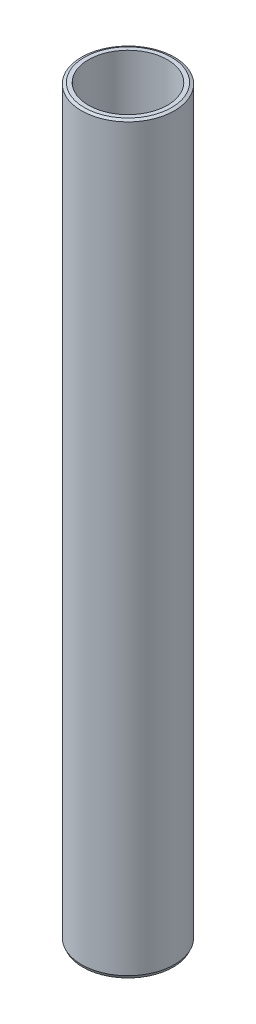
ISO-10303-21;
HEADER;
FILE_DESCRIPTION(('STEP AP214'),'2;1');
FILE_NAME('part.step','',(''),(''),'','','');
FILE_SCHEMA(('AUTOMOTIVE_DESIGN { 1 0 10303 214 1 1 1 1 }'));
ENDSEC;
DATA;
#1=APPLICATION_CONTEXT('core data for automotive mechanical design processes');
#2=APPLICATION_PROTOCOL_DEFINITION('international standard','automotive_design',2000,#1);
#3=PRODUCT_CONTEXT('',#1,'mechanical');
#4=PRODUCT('Part','Part','',(#3));
#5=PRODUCT_RELATED_PRODUCT_CATEGORY('part','',(#4));
#6=PRODUCT_DEFINITION_FORMATION('','',#4);
#7=PRODUCT_DEFINITION_CONTEXT('part definition',#1,'design');
#8=PRODUCT_DEFINITION('design','',#6,#7);
#9=PRODUCT_DEFINITION_SHAPE('','',#8);
#10=(LENGTH_UNIT() NAMED_UNIT(*) SI_UNIT(.MILLI.,.METRE.));
#11=(NAMED_UNIT(*) PLANE_ANGLE_UNIT() SI_UNIT($,.RADIAN.));
#12=(NAMED_UNIT(*) SI_UNIT($,.STERADIAN.) SOLID_ANGLE_UNIT());
#13=UNCERTAINTY_MEASURE_WITH_UNIT(LENGTH_MEASURE(1.E-05),#10,'distance_accuracy_value','');
#14=(GEOMETRIC_REPRESENTATION_CONTEXT(3) GLOBAL_UNCERTAINTY_ASSIGNED_CONTEXT((#13)) GLOBAL_UNIT_ASSIGNED_CONTEXT((#10,
#11,#12)) REPRESENTATION_CONTEXT('',''));
#15=CARTESIAN_POINT('',(0.,0.,0.));
#16=DIRECTION('',(0.,0.,1.));
#17=DIRECTION('',(1.,0.,0.));
#18=AXIS2_PLACEMENT_3D('',#15,#16,#17);
#19=CARTESIAN_POINT('',(0.,600.,0.));
#20=DIRECTION('',(0.,-1.,0.));
#21=DIRECTION('',(0.,0.,-1.));
#22=AXIS2_PLACEMENT_3D('',#19,#20,#21);
#23=CYLINDRICAL_SURFACE('',#22,37.5);
#24=CARTESIAN_POINT('',(0.,598.958116109623,0.));
#25=DIRECTION('',(0.,1.,0.));
#26=DIRECTION('',(0.,0.,1.));
#27=AXIS2_PLACEMENT_3D('',#24,#25,#26);
#28=CIRCLE('',#27,37.5);
#29=CARTESIAN_POINT('',(0.,598.958116109623,37.5));
#30=VERTEX_POINT('',#29);
#31=EDGE_CURVE('E50',#30,#30,#28,.F.);
#32=ORIENTED_EDGE('',*,*,#31,.T.);
#33=EDGE_LOOP('',(#32));
#34=FACE_BOUND('',#33,.T.);
#35=CARTESIAN_POINT('',(0.,2.32432728901266,0.));
#36=DIRECTION('',(0.,1.,0.));
#37=DIRECTION('',(0.,0.,1.));
#38=AXIS2_PLACEMENT_3D('',#35,#36,#37);
#39=CIRCLE('',#38,37.5);
#40=CARTESIAN_POINT('',(0.,2.32432728901266,37.5));
#41=VERTEX_POINT('',#40);
#42=EDGE_CURVE('E51',#41,#41,#39,.T.);
#43=ORIENTED_EDGE('',*,*,#42,.T.);
#44=EDGE_LOOP('',(#43));
#45=FACE_BOUND('',#44,.T.);
#46=ADVANCED_FACE('F39',(#34,#45),#23,.T.);
#47=CARTESIAN_POINT('',(0.,600.,0.));
#48=DIRECTION('',(0.,1.,0.));
#49=DIRECTION('',(0.,0.,1.));
#50=AXIS2_PLACEMENT_3D('',#47,#48,#49);
#51=PLANE('',#50);
#52=CARTESIAN_POINT('',(0.,600.,0.));
#53=DIRECTION('',(0.,1.,0.));
#54=DIRECTION('',(0.,0.,1.));
#55=AXIS2_PLACEMENT_3D('',#52,#53,#54);
#56=CIRCLE('',#55,35.1756727109879);
#57=CARTESIAN_POINT('',(0.,600.,35.1756727109879));
#58=VERTEX_POINT('',#57);
#59=EDGE_CURVE('E54',#58,#58,#56,.T.);
#60=ORIENTED_EDGE('',*,*,#59,.T.);
#61=EDGE_LOOP('',(#60));
#62=FACE_BOUND('',#61,.T.);
#63=CARTESIAN_POINT('',(0.,600.,0.));
#64=DIRECTION('',(0.,1.,0.));
#65=DIRECTION('',(0.,0.,1.));
#66=AXIS2_PLACEMENT_3D('',#63,#64,#65);
#67=CIRCLE('',#66,31.8581075449418);
#68=CARTESIAN_POINT('',(0.,600.,31.8581075449418));
#69=VERTEX_POINT('',#68);
#70=EDGE_CURVE('E58',#69,#69,#67,.T.);
#71=ORIENTED_EDGE('',*,*,#70,.F.);
#72=EDGE_LOOP('',(#71));
#73=FACE_BOUND('',#72,.T.);
#74=ADVANCED_FACE('F69',(#62,#73),#51,.T.);
#75=CARTESIAN_POINT('',(0.,0.,0.));
#76=DIRECTION('',(0.,1.,0.));
#77=DIRECTION('',(0.,0.,1.));
#78=AXIS2_PLACEMENT_3D('',#75,#76,#77);
#79=PLANE('',#78);
#80=CARTESIAN_POINT('',(0.,0.,0.));
#81=DIRECTION('',(0.,1.,0.));
#82=DIRECTION('',(0.,0.,1.));
#83=AXIS2_PLACEMENT_3D('',#80,#81,#82);
#84=CIRCLE('',#83,36.4581161096232);
#85=CARTESIAN_POINT('',(0.,0.,36.4581161096232));
#86=VERTEX_POINT('',#85);
#87=EDGE_CURVE('E10',#86,#86,#84,.F.);
#88=ORIENTED_EDGE('',*,*,#87,.T.);
#89=EDGE_LOOP('',(#88));
#90=FACE_BOUND('',#89,.T.);
#91=CARTESIAN_POINT('',(0.,0.,0.));
#92=DIRECTION('',(0.,1.,0.));
#93=DIRECTION('',(0.,0.,1.));
#94=AXIS2_PLACEMENT_3D('',#91,#92,#93);
#95=CIRCLE('',#94,31.8581075449418);
#96=CARTESIAN_POINT('',(0.,0.,31.8581075449418));
#97=VERTEX_POINT('',#96);
#98=EDGE_CURVE('E63',#97,#97,#95,.T.);
#99=ORIENTED_EDGE('',*,*,#98,.T.);
#100=EDGE_LOOP('',(#99));
#101=FACE_BOUND('',#100,.T.);
#102=ADVANCED_FACE('F75',(#90,#101),#79,.F.);
#103=CARTESIAN_POINT('',(0.,600.,0.));
#104=DIRECTION('',(0.,-1.,0.));
#105=DIRECTION('',(0.,0.,-1.));
#106=AXIS2_PLACEMENT_3D('',#103,#104,#105);
#107=CYLINDRICAL_SURFACE('',#106,31.8581075449418);
#108=ORIENTED_EDGE('',*,*,#70,.T.);
#109=EDGE_LOOP('',(#108));
#110=FACE_BOUND('',#109,.T.);
#111=ORIENTED_EDGE('',*,*,#98,.F.);
#112=EDGE_LOOP('',(#111));
#113=FACE_BOUND('',#112,.T.);
#114=ADVANCED_FACE('F70',(#110,#113),#107,.F.);
#115=CARTESIAN_POINT('',(0.,600.,0.));
#116=DIRECTION('',(0.,-1.,0.));
#117=DIRECTION('',(0.,0.,-1.));
#118=AXIS2_PLACEMENT_3D('',#115,#116,#117);
#119=CONICAL_SURFACE('',#118,35.1756727109879,1.14939715618381);
#120=ORIENTED_EDGE('',*,*,#31,.F.);
#121=EDGE_LOOP('',(#120));
#122=FACE_BOUND('',#121,.T.);
#123=ORIENTED_EDGE('',*,*,#59,.F.);
#124=EDGE_LOOP('',(#123));
#125=FACE_BOUND('',#124,.T.);
#126=ADVANCED_FACE('F81',(#122,#125),#119,.T.);
#127=CARTESIAN_POINT('',(0.,2.32432728901266,0.));
#128=DIRECTION('',(0.,1.,0.));
#129=DIRECTION('',(0.,0.,1.));
#130=AXIS2_PLACEMENT_3D('',#127,#128,#129);
#131=CONICAL_SURFACE('',#130,37.5,0.421399170611114);
#132=ORIENTED_EDGE('',*,*,#87,.F.);
#133=EDGE_LOOP('',(#132));
#134=FACE_BOUND('',#133,.T.);
#135=ORIENTED_EDGE('',*,*,#42,.F.);
#136=EDGE_LOOP('',(#135));
#137=FACE_BOUND('',#136,.T.);
#138=ADVANCED_FACE('F45',(#134,#137),#131,.T.);
#139=CLOSED_SHELL('',(#46,#74,#102,#114,#126,#138));
#140=MANIFOLD_SOLID_BREP('B2',#139);
#141=ADVANCED_BREP_SHAPE_REPRESENTATION('',(#18,#140),#14);
#142=SHAPE_DEFINITION_REPRESENTATION(#9,#141);
ENDSEC;
END-ISO-10303-21;
